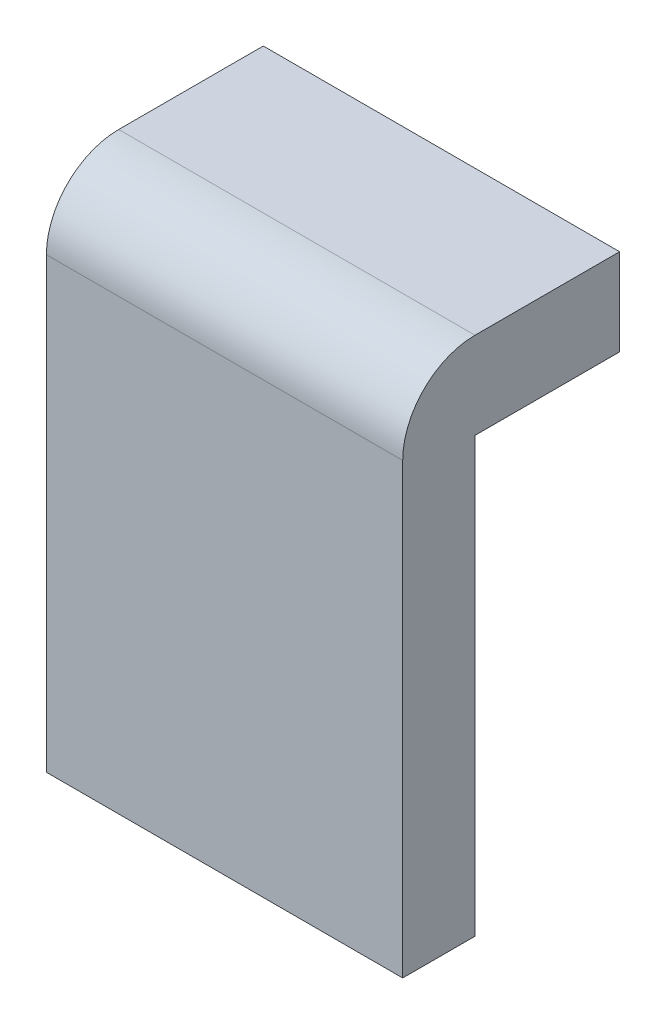
ISO-10303-21;
HEADER;
FILE_DESCRIPTION(('STEP AP214'),'2;1');
FILE_NAME('part.step','',(''),(''),'','','');
FILE_SCHEMA(('AUTOMOTIVE_DESIGN { 1 0 10303 214 1 1 1 1 }'));
ENDSEC;
DATA;
#1=APPLICATION_CONTEXT('core data for automotive mechanical design processes');
#2=APPLICATION_PROTOCOL_DEFINITION('international standard','automotive_design',2000,#1);
#3=PRODUCT_CONTEXT('',#1,'mechanical');
#4=PRODUCT('Part','Part','',(#3));
#5=PRODUCT_RELATED_PRODUCT_CATEGORY('part','',(#4));
#6=PRODUCT_DEFINITION_FORMATION('','',#4);
#7=PRODUCT_DEFINITION_CONTEXT('part definition',#1,'design');
#8=PRODUCT_DEFINITION('design','',#6,#7);
#9=PRODUCT_DEFINITION_SHAPE('','',#8);
#10=(LENGTH_UNIT() NAMED_UNIT(*) SI_UNIT(.MILLI.,.METRE.));
#11=(NAMED_UNIT(*) PLANE_ANGLE_UNIT() SI_UNIT($,.RADIAN.));
#12=(NAMED_UNIT(*) SI_UNIT($,.STERADIAN.) SOLID_ANGLE_UNIT());
#13=UNCERTAINTY_MEASURE_WITH_UNIT(LENGTH_MEASURE(1.E-05),#10,'distance_accuracy_value','');
#14=(GEOMETRIC_REPRESENTATION_CONTEXT(3) GLOBAL_UNCERTAINTY_ASSIGNED_CONTEXT((#13)) GLOBAL_UNIT_ASSIGNED_CONTEXT((#10,
#11,#12)) REPRESENTATION_CONTEXT('',''));
#15=CARTESIAN_POINT('',(0.,0.,0.));
#16=DIRECTION('',(0.,0.,1.));
#17=DIRECTION('',(1.,0.,0.));
#18=AXIS2_PLACEMENT_3D('',#15,#16,#17);
#19=CARTESIAN_POINT('',(-8.34906661620967,8.30000000000001,12.2546737770755));
#20=DIRECTION('',(0.,0.,1.));
#21=DIRECTION('',(0.,-1.,0.));
#22=AXIS2_PLACEMENT_3D('',#19,#20,#21);
#23=PLANE('',#22);
#24=DIRECTION('',(1.,0.,0.));
#25=VECTOR('',#24,1.);
#26=CARTESIAN_POINT('',(-15.8147962412963,6.80000000000003,12.2546737770755));
#27=LINE('',#26,#25);
#28=CARTESIAN_POINT('',(6.65467418628921,6.80000000000003,12.2546737770755));
#29=VERTEX_POINT('',#28);
#30=CARTESIAN_POINT('',(7.88682494272993,6.80000000000003,12.2546737770755));
#31=VERTEX_POINT('',#30);
#32=EDGE_CURVE('E113',#29,#31,#27,.T.);
#33=ORIENTED_EDGE('',*,*,#32,.F.);
#34=DIRECTION('',(0.,1.,0.));
#35=VECTOR('',#34,1.);
#36=CARTESIAN_POINT('',(6.65467418628921,5.35753839337147,12.2546737770755));
#37=LINE('',#36,#35);
#38=CARTESIAN_POINT('',(6.65467418628921,8.30000000000001,12.2546737770755));
#39=VERTEX_POINT('',#38);
#40=EDGE_CURVE('E148',#39,#29,#37,.F.);
#41=ORIENTED_EDGE('',*,*,#40,.F.);
#42=DIRECTION('',(1.,0.,0.));
#43=VECTOR('',#42,1.);
#44=CARTESIAN_POINT('',(-8.34906661620967,8.30000000000001,12.2546737770755));
#45=LINE('',#44,#43);
#46=CARTESIAN_POINT('',(7.88682494272994,8.30000000000001,12.2546737770755));
#47=VERTEX_POINT('',#46);
#48=EDGE_CURVE('E133',#39,#47,#45,.T.);
#49=ORIENTED_EDGE('',*,*,#48,.T.);
#50=DIRECTION('',(0.,1.,0.));
#51=VECTOR('',#50,1.);
#52=CARTESIAN_POINT('',(7.88682494272994,5.35753839337147,12.2546737770755));
#53=LINE('',#52,#51);
#54=EDGE_CURVE('E105',#31,#47,#53,.T.);
#55=ORIENTED_EDGE('',*,*,#54,.F.);
#56=EDGE_LOOP('',(#33,#41,#49,#55));
#57=FACE_BOUND('',#56,.T.);
#58=ADVANCED_FACE('F17',(#57),#23,.F.);
#59=CARTESIAN_POINT('',(-8.34906661620967,8.30000000000001,11.7546737770755));
#60=DIRECTION('',(0.,1.,0.));
#61=DIRECTION('',(0.,0.,1.));
#62=AXIS2_PLACEMENT_3D('',#59,#60,#61);
#63=PLANE('',#62);
#64=ORIENTED_EDGE('',*,*,#48,.F.);
#65=DIRECTION('',(0.,0.,1.));
#66=VECTOR('',#65,1.);
#67=CARTESIAN_POINT('',(6.65467418628921,8.30000000000001,12.5046737770755));
#68=LINE('',#67,#66);
#69=CARTESIAN_POINT('',(6.65467418628921,8.30000000000001,11.7546737770755));
#70=VERTEX_POINT('',#69);
#71=EDGE_CURVE('E153',#70,#39,#68,.T.);
#72=ORIENTED_EDGE('',*,*,#71,.F.);
#73=DIRECTION('',(1.,0.,0.));
#74=VECTOR('',#73,1.);
#75=CARTESIAN_POINT('',(6.65467418628921,8.30000000000001,11.7546737770755));
#76=LINE('',#75,#74);
#77=CARTESIAN_POINT('',(7.88682494272994,8.30000000000001,11.7546737770755));
#78=VERTEX_POINT('',#77);
#79=EDGE_CURVE('E124',#78,#70,#76,.F.);
#80=ORIENTED_EDGE('',*,*,#79,.F.);
#81=DIRECTION('',(0.,0.,-1.));
#82=VECTOR('',#81,1.);
#83=CARTESIAN_POINT('',(7.88682494272994,8.30000000000001,12.5046737770755));
#84=LINE('',#83,#82);
#85=EDGE_CURVE('E129',#47,#78,#84,.T.);
#86=ORIENTED_EDGE('',*,*,#85,.F.);
#87=EDGE_LOOP('',(#64,#72,#80,#86));
#88=FACE_BOUND('',#87,.T.);
#89=ADVANCED_FACE('F175',(#88),#63,.F.);
#90=CARTESIAN_POINT('',(6.65467418628921,5.35753839337146,11.7546737770755));
#91=DIRECTION('',(0.,0.,-1.));
#92=DIRECTION('',(0.,1.,0.));
#93=AXIS2_PLACEMENT_3D('',#90,#91,#92);
#94=PLANE('',#93);
#95=ORIENTED_EDGE('',*,*,#79,.T.);
#96=DIRECTION('',(0.,1.,0.));
#97=VECTOR('',#96,1.);
#98=CARTESIAN_POINT('',(6.65467418628921,5.35753839337147,11.7546737770755));
#99=LINE('',#98,#97);
#100=CARTESIAN_POINT('',(6.65467418628921,8.6,11.7546737770755));
#101=VERTEX_POINT('',#100);
#102=EDGE_CURVE('E119',#101,#70,#99,.F.);
#103=ORIENTED_EDGE('',*,*,#102,.F.);
#104=DIRECTION('',(1.,0.,0.));
#105=VECTOR('',#104,1.);
#106=CARTESIAN_POINT('',(-8.34906661620967,8.6,11.7546737770755));
#107=LINE('',#106,#105);
#108=CARTESIAN_POINT('',(7.88682494272994,8.6,11.7546737770755));
#109=VERTEX_POINT('',#108);
#110=EDGE_CURVE('E122',#101,#109,#107,.T.);
#111=ORIENTED_EDGE('',*,*,#110,.T.);
#112=DIRECTION('',(0.,1.,0.));
#113=VECTOR('',#112,1.);
#114=CARTESIAN_POINT('',(7.88682494272994,5.35753839337147,11.7546737770755));
#115=LINE('',#114,#113);
#116=EDGE_CURVE('E97',#78,#109,#115,.T.);
#117=ORIENTED_EDGE('',*,*,#116,.F.);
#118=EDGE_LOOP('',(#95,#103,#111,#117));
#119=FACE_BOUND('',#118,.T.);
#120=ADVANCED_FACE('F172',(#119),#94,.T.);
#121=CARTESIAN_POINT('',(-8.34906661620967,8.6,11.7546737770755));
#122=DIRECTION('',(0.,-1.,0.));
#123=DIRECTION('',(0.,0.,-1.));
#124=AXIS2_PLACEMENT_3D('',#121,#122,#123);
#125=PLANE('',#124);
#126=ORIENTED_EDGE('',*,*,#110,.F.);
#127=DIRECTION('',(0.,0.,1.));
#128=VECTOR('',#127,1.);
#129=CARTESIAN_POINT('',(6.65467418628921,8.6,12.5046737770755));
#130=LINE('',#129,#128);
#131=CARTESIAN_POINT('',(6.65467418628921,8.6,12.2546737770755));
#132=VERTEX_POINT('',#131);
#133=EDGE_CURVE('E83',#132,#101,#130,.F.);
#134=ORIENTED_EDGE('',*,*,#133,.F.);
#135=DIRECTION('',(1.,0.,0.));
#136=VECTOR('',#135,1.);
#137=CARTESIAN_POINT('',(-8.34906661620967,8.6,12.2546737770755));
#138=LINE('',#137,#136);
#139=CARTESIAN_POINT('',(7.88682494272993,8.6,12.2546737770755));
#140=VERTEX_POINT('',#139);
#141=EDGE_CURVE('E79',#140,#132,#138,.F.);
#142=ORIENTED_EDGE('',*,*,#141,.F.);
#143=DIRECTION('',(0.,0.,-1.));
#144=VECTOR('',#143,1.);
#145=CARTESIAN_POINT('',(7.88682494272994,8.6,12.5046737770755));
#146=LINE('',#145,#144);
#147=EDGE_CURVE('E94',#109,#140,#146,.F.);
#148=ORIENTED_EDGE('',*,*,#147,.F.);
#149=EDGE_LOOP('',(#126,#134,#142,#148));
#150=FACE_BOUND('',#149,.T.);
#151=ADVANCED_FACE('F168',(#150),#125,.F.);
#152=CARTESIAN_POINT('',(-8.34906661620967,8.35,12.2546737770755));
#153=DIRECTION('',(1.,0.,0.));
#154=DIRECTION('',(0.,0.,-1.));
#155=AXIS2_PLACEMENT_3D('',#152,#153,#154);
#156=CYLINDRICAL_SURFACE('',#155,0.249999999999995);
#157=CARTESIAN_POINT('',(6.65467418628921,8.35,12.2546737770755));
#158=DIRECTION('',(1.,0.,0.));
#159=DIRECTION('',(0.,0.,-1.));
#160=AXIS2_PLACEMENT_3D('',#157,#158,#159);
#161=CIRCLE('',#160,0.249999999999995);
#162=CARTESIAN_POINT('',(6.65467418628921,8.35,12.5046737770755));
#163=VERTEX_POINT('',#162);
#164=EDGE_CURVE('E20',#163,#132,#161,.F.);
#165=ORIENTED_EDGE('',*,*,#164,.F.);
#166=DIRECTION('',(1.,0.,0.));
#167=VECTOR('',#166,1.);
#168=CARTESIAN_POINT('',(6.65467418628921,8.35,12.5046737770755));
#169=LINE('',#168,#167);
#170=CARTESIAN_POINT('',(7.88682494272993,8.35,12.5046737770755));
#171=VERTEX_POINT('',#170);
#172=EDGE_CURVE('E77',#171,#163,#169,.F.);
#173=ORIENTED_EDGE('',*,*,#172,.F.);
#174=CARTESIAN_POINT('',(7.88682494272993,8.35,12.2546737770755));
#175=DIRECTION('',(1.,0.,0.));
#176=DIRECTION('',(0.,0.,-1.));
#177=AXIS2_PLACEMENT_3D('',#174,#175,#176);
#178=CIRCLE('',#177,0.249999999999995);
#179=EDGE_CURVE('E106',#140,#171,#178,.T.);
#180=ORIENTED_EDGE('',*,*,#179,.F.);
#181=ORIENTED_EDGE('',*,*,#141,.T.);
#182=EDGE_LOOP('',(#165,#173,#180,#181));
#183=FACE_BOUND('',#182,.T.);
#184=ADVANCED_FACE('F74',(#183),#156,.T.);
#185=CARTESIAN_POINT('',(6.65467418628921,5.35753839337147,12.5046737770755));
#186=DIRECTION('',(-1.,0.,0.));
#187=DIRECTION('',(0.,0.,1.));
#188=AXIS2_PLACEMENT_3D('',#185,#186,#187);
#189=PLANE('',#188);
#190=DIRECTION('',(0.,0.,-1.));
#191=VECTOR('',#190,1.);
#192=CARTESIAN_POINT('',(6.65467418628921,6.80000000000003,12.5046737770755));
#193=LINE('',#192,#191);
#194=CARTESIAN_POINT('',(6.65467418628921,6.80000000000003,12.5046737770755));
#195=VERTEX_POINT('',#194);
#196=EDGE_CURVE('E89',#195,#29,#193,.T.);
#197=ORIENTED_EDGE('',*,*,#196,.F.);
#198=DIRECTION('',(0.,-1.,0.));
#199=VECTOR('',#198,1.);
#200=CARTESIAN_POINT('',(6.65467418628921,5.35753839337147,12.5046737770755));
#201=LINE('',#200,#199);
#202=EDGE_CURVE('E85',#163,#195,#201,.T.);
#203=ORIENTED_EDGE('',*,*,#202,.F.);
#204=ORIENTED_EDGE('',*,*,#164,.T.);
#205=ORIENTED_EDGE('',*,*,#133,.T.);
#206=ORIENTED_EDGE('',*,*,#102,.T.);
#207=ORIENTED_EDGE('',*,*,#71,.T.);
#208=ORIENTED_EDGE('',*,*,#40,.T.);
#209=EDGE_LOOP('',(#197,#203,#204,#205,#206,#207,#208));
#210=FACE_BOUND('',#209,.T.);
#211=ADVANCED_FACE('F86',(#210),#189,.T.);
#212=CARTESIAN_POINT('',(-15.8147962412963,6.80000000000003,12.5046737770755));
#213=DIRECTION('',(0.,-1.,0.));
#214=DIRECTION('',(0.,0.,-1.));
#215=AXIS2_PLACEMENT_3D('',#212,#213,#214);
#216=PLANE('',#215);
#217=DIRECTION('',(1.,0.,0.));
#218=VECTOR('',#217,1.);
#219=CARTESIAN_POINT('',(6.65467418628921,6.80000000000003,12.5046737770755));
#220=LINE('',#219,#218);
#221=CARTESIAN_POINT('',(7.88682494272994,6.80000000000003,12.5046737770755));
#222=VERTEX_POINT('',#221);
#223=EDGE_CURVE('E26',#195,#222,#220,.T.);
#224=ORIENTED_EDGE('',*,*,#223,.F.);
#225=ORIENTED_EDGE('',*,*,#196,.T.);
#226=ORIENTED_EDGE('',*,*,#32,.T.);
#227=DIRECTION('',(0.,0.,-1.));
#228=VECTOR('',#227,1.);
#229=CARTESIAN_POINT('',(7.88682494272994,6.80000000000003,12.5046737770755));
#230=LINE('',#229,#228);
#231=EDGE_CURVE('E35',#222,#31,#230,.T.);
#232=ORIENTED_EDGE('',*,*,#231,.F.);
#233=EDGE_LOOP('',(#224,#225,#226,#232));
#234=FACE_BOUND('',#233,.T.);
#235=ADVANCED_FACE('F179',(#234),#216,.T.);
#236=CARTESIAN_POINT('',(7.88682494272994,5.35753839337147,12.5046737770755));
#237=DIRECTION('',(1.,0.,0.));
#238=DIRECTION('',(0.,0.,-1.));
#239=AXIS2_PLACEMENT_3D('',#236,#237,#238);
#240=PLANE('',#239);
#241=ORIENTED_EDGE('',*,*,#116,.T.);
#242=ORIENTED_EDGE('',*,*,#147,.T.);
#243=ORIENTED_EDGE('',*,*,#179,.T.);
#244=DIRECTION('',(0.,-1.,0.));
#245=VECTOR('',#244,1.);
#246=CARTESIAN_POINT('',(7.88682494272994,5.35753839337147,12.5046737770755));
#247=LINE('',#246,#245);
#248=EDGE_CURVE('E11',#222,#171,#247,.F.);
#249=ORIENTED_EDGE('',*,*,#248,.F.);
#250=ORIENTED_EDGE('',*,*,#231,.T.);
#251=ORIENTED_EDGE('',*,*,#54,.T.);
#252=ORIENTED_EDGE('',*,*,#85,.T.);
#253=EDGE_LOOP('',(#241,#242,#243,#249,#250,#251,#252));
#254=FACE_BOUND('',#253,.T.);
#255=ADVANCED_FACE('F164',(#254),#240,.T.);
#256=CARTESIAN_POINT('',(6.65467418628921,5.35753839337147,12.5046737770755));
#257=DIRECTION('',(0.,0.,1.));
#258=DIRECTION('',(0.,-1.,0.));
#259=AXIS2_PLACEMENT_3D('',#256,#257,#258);
#260=PLANE('',#259);
#261=ORIENTED_EDGE('',*,*,#223,.T.);
#262=ORIENTED_EDGE('',*,*,#248,.T.);
#263=ORIENTED_EDGE('',*,*,#172,.T.);
#264=ORIENTED_EDGE('',*,*,#202,.T.);
#265=EDGE_LOOP('',(#261,#262,#263,#264));
#266=FACE_BOUND('',#265,.T.);
#267=ADVANCED_FACE('F93',(#266),#260,.T.);
#268=CLOSED_SHELL('',(#58,#89,#120,#151,#184,#211,#235,#255,#267));
#269=MANIFOLD_SOLID_BREP('B1',#268);
#270=ADVANCED_BREP_SHAPE_REPRESENTATION('',(#18,#269),#14);
#271=SHAPE_DEFINITION_REPRESENTATION(#9,#270);
ENDSEC;
END-ISO-10303-21;
